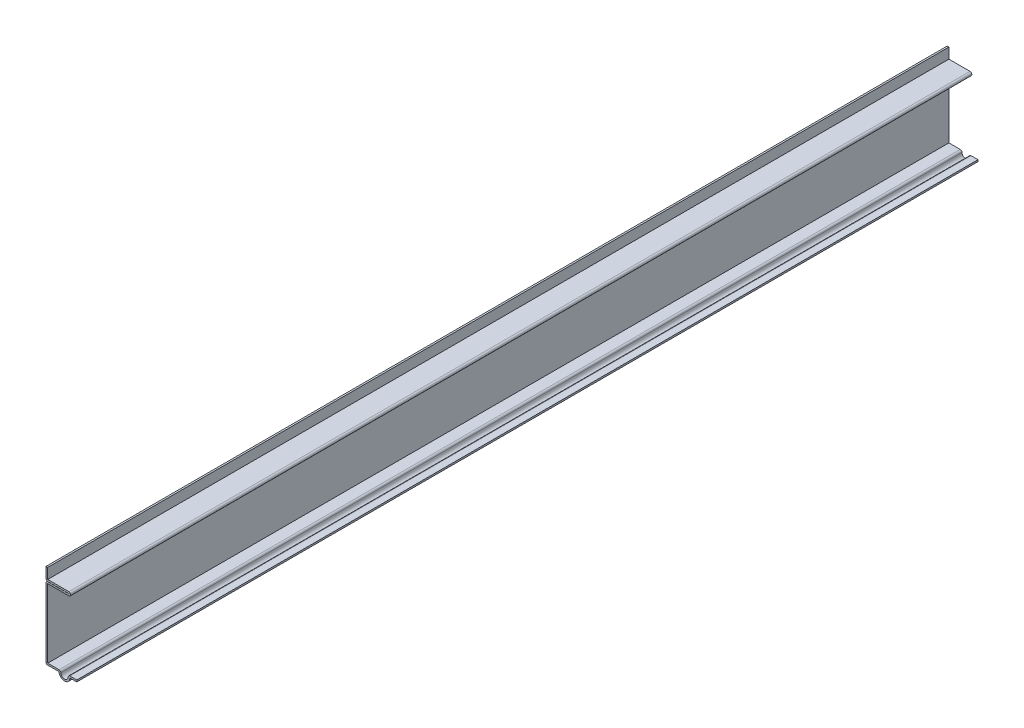
ISO-10303-21;
HEADER;
FILE_DESCRIPTION(('STEP AP214'),'2;1');
FILE_NAME('part.step','',(''),(''),'','','');
FILE_SCHEMA(('AUTOMOTIVE_DESIGN { 1 0 10303 214 1 1 1 1 }'));
ENDSEC;
DATA;
#1=APPLICATION_CONTEXT('core data for automotive mechanical design processes');
#2=APPLICATION_PROTOCOL_DEFINITION('international standard','automotive_design',2000,#1);
#3=PRODUCT_CONTEXT('',#1,'mechanical');
#4=PRODUCT('Part','Part','',(#3));
#5=PRODUCT_RELATED_PRODUCT_CATEGORY('part','',(#4));
#6=PRODUCT_DEFINITION_FORMATION('','',#4);
#7=PRODUCT_DEFINITION_CONTEXT('part definition',#1,'design');
#8=PRODUCT_DEFINITION('design','',#6,#7);
#9=PRODUCT_DEFINITION_SHAPE('','',#8);
#10=(LENGTH_UNIT() NAMED_UNIT(*) SI_UNIT(.MILLI.,.METRE.));
#11=(NAMED_UNIT(*) PLANE_ANGLE_UNIT() SI_UNIT($,.RADIAN.));
#12=(NAMED_UNIT(*) SI_UNIT($,.STERADIAN.) SOLID_ANGLE_UNIT());
#13=UNCERTAINTY_MEASURE_WITH_UNIT(LENGTH_MEASURE(1.E-05),#10,'distance_accuracy_value','');
#14=(GEOMETRIC_REPRESENTATION_CONTEXT(3) GLOBAL_UNCERTAINTY_ASSIGNED_CONTEXT((#13)) GLOBAL_UNIT_ASSIGNED_CONTEXT((#10,
#11,#12)) REPRESENTATION_CONTEXT('',''));
#15=CARTESIAN_POINT('',(0.,0.,0.));
#16=DIRECTION('',(0.,0.,1.));
#17=DIRECTION('',(1.,0.,0.));
#18=AXIS2_PLACEMENT_3D('',#15,#16,#17);
#19=CARTESIAN_POINT('',(-3.571875,0.,-464.34375));
#20=DIRECTION('',(0.,-1.,0.));
#21=DIRECTION('',(0.,0.,-1.));
#22=AXIS2_PLACEMENT_3D('',#19,#20,#21);
#23=PLANE('',#22);
#24=DIRECTION('',(1.,0.,0.));
#25=VECTOR('',#24,1.);
#26=CARTESIAN_POINT('',(-3.571875,0.,0.));
#27=LINE('',#26,#25);
#28=CARTESIAN_POINT('',(-3.571875,0.,0.));
#29=VERTEX_POINT('',#28);
#30=CARTESIAN_POINT('',(0.,0.,0.));
#31=VERTEX_POINT('',#30);
#32=EDGE_CURVE('E256',#29,#31,#27,.T.);
#33=ORIENTED_EDGE('',*,*,#32,.F.);
#34=DIRECTION('',(0.,0.,1.));
#35=VECTOR('',#34,1.);
#36=CARTESIAN_POINT('',(-3.571875,0.,-464.34375));
#37=LINE('',#36,#35);
#38=CARTESIAN_POINT('',(-3.571875,0.,-464.34375));
#39=VERTEX_POINT('',#38);
#40=EDGE_CURVE('E214',#39,#29,#37,.T.);
#41=ORIENTED_EDGE('',*,*,#40,.F.);
#42=DIRECTION('',(1.,0.,0.));
#43=VECTOR('',#42,1.);
#44=CARTESIAN_POINT('',(-3.571875,0.,-464.34375));
#45=LINE('',#44,#43);
#46=CARTESIAN_POINT('',(0.,0.,-464.34375));
#47=VERTEX_POINT('',#46);
#48=EDGE_CURVE('E196',#39,#47,#45,.T.);
#49=ORIENTED_EDGE('',*,*,#48,.T.);
#50=DIRECTION('',(0.,0.,1.));
#51=VECTOR('',#50,1.);
#52=CARTESIAN_POINT('',(0.,0.,-464.34375));
#53=LINE('',#52,#51);
#54=EDGE_CURVE('E204',#47,#31,#53,.T.);
#55=ORIENTED_EDGE('',*,*,#54,.T.);
#56=EDGE_LOOP('',(#33,#41,#49,#55));
#57=FACE_BOUND('',#56,.T.);
#58=ADVANCED_FACE('F35',(#57),#23,.T.);
#59=CARTESIAN_POINT('',(-6.35,0.,-464.34375));
#60=DIRECTION('',(0.,0.,1.));
#61=DIRECTION('',(1.,0.,0.));
#62=AXIS2_PLACEMENT_3D('',#59,#60,#61);
#63=CYLINDRICAL_SURFACE('',#62,2.778125);
#64=CARTESIAN_POINT('',(-6.35,0.,0.));
#65=DIRECTION('',(0.,0.,1.));
#66=DIRECTION('',(1.,0.,0.));
#67=AXIS2_PLACEMENT_3D('',#64,#65,#66);
#68=CIRCLE('',#67,2.778125);
#69=CARTESIAN_POINT('',(-9.128125,0.,0.));
#70=VERTEX_POINT('',#69);
#71=EDGE_CURVE('E215',#70,#29,#68,.T.);
#72=ORIENTED_EDGE('',*,*,#71,.F.);
#73=DIRECTION('',(0.,0.,1.));
#74=VECTOR('',#73,1.);
#75=CARTESIAN_POINT('',(-9.128125,0.,-464.34375));
#76=LINE('',#75,#74);
#77=CARTESIAN_POINT('',(-9.128125,0.,-464.34375));
#78=VERTEX_POINT('',#77);
#79=EDGE_CURVE('E295',#78,#70,#76,.T.);
#80=ORIENTED_EDGE('',*,*,#79,.F.);
#81=CARTESIAN_POINT('',(-6.35,0.,-464.34375));
#82=DIRECTION('',(0.,0.,1.));
#83=DIRECTION('',(1.,0.,0.));
#84=AXIS2_PLACEMENT_3D('',#81,#82,#83);
#85=CIRCLE('',#84,2.778125);
#86=EDGE_CURVE('E212',#78,#39,#85,.T.);
#87=ORIENTED_EDGE('',*,*,#86,.T.);
#88=ORIENTED_EDGE('',*,*,#40,.T.);
#89=EDGE_LOOP('',(#72,#80,#87,#88));
#90=FACE_BOUND('',#89,.T.);
#91=ADVANCED_FACE('F386',(#90),#63,.T.);
#92=CARTESIAN_POINT('',(-15.875,0.,-464.34375));
#93=DIRECTION('',(0.,-1.,0.));
#94=DIRECTION('',(0.,0.,-1.));
#95=AXIS2_PLACEMENT_3D('',#92,#93,#94);
#96=PLANE('',#95);
#97=DIRECTION('',(1.,0.,0.));
#98=VECTOR('',#97,1.);
#99=CARTESIAN_POINT('',(-15.875,0.,0.));
#100=LINE('',#99,#98);
#101=CARTESIAN_POINT('',(-14.986,0.,0.));
#102=VERTEX_POINT('',#101);
#103=EDGE_CURVE('E218',#102,#70,#100,.T.);
#104=ORIENTED_EDGE('',*,*,#103,.F.);
#105=DIRECTION('',(0.,0.,1.));
#106=VECTOR('',#105,1.);
#107=CARTESIAN_POINT('',(-14.986,0.,-464.34375));
#108=LINE('',#107,#106);
#109=CARTESIAN_POINT('',(-14.986,0.,-464.34375));
#110=VERTEX_POINT('',#109);
#111=EDGE_CURVE('E11',#102,#110,#108,.F.);
#112=ORIENTED_EDGE('',*,*,#111,.T.);
#113=DIRECTION('',(1.,0.,0.));
#114=VECTOR('',#113,1.);
#115=CARTESIAN_POINT('',(-15.875,0.,-464.34375));
#116=LINE('',#115,#114);
#117=EDGE_CURVE('E253',#110,#78,#116,.T.);
#118=ORIENTED_EDGE('',*,*,#117,.T.);
#119=ORIENTED_EDGE('',*,*,#79,.T.);
#120=EDGE_LOOP('',(#104,#112,#118,#119));
#121=FACE_BOUND('',#120,.T.);
#122=ADVANCED_FACE('F464',(#121),#96,.T.);
#123=CARTESIAN_POINT('',(-15.875,37.25545,-464.34375));
#124=DIRECTION('',(-1.,0.,0.));
#125=DIRECTION('',(0.,-1.,0.));
#126=AXIS2_PLACEMENT_3D('',#123,#124,#125);
#127=PLANE('',#126);
#128=DIRECTION('',(0.,-1.,0.));
#129=VECTOR('',#128,1.);
#130=CARTESIAN_POINT('',(-15.875,37.25545,0.));
#131=LINE('',#130,#129);
#132=CARTESIAN_POINT('',(-15.875,36.36645,0.));
#133=VERTEX_POINT('',#132);
#134=CARTESIAN_POINT('',(-15.875,0.889000000000001,0.));
#135=VERTEX_POINT('',#134);
#136=EDGE_CURVE('E289',#133,#135,#131,.T.);
#137=ORIENTED_EDGE('',*,*,#136,.F.);
#138=DIRECTION('',(0.,0.,1.));
#139=VECTOR('',#138,1.);
#140=CARTESIAN_POINT('',(-15.875,36.36645,-464.34375));
#141=LINE('',#140,#139);
#142=CARTESIAN_POINT('',(-15.875,36.36645,-464.34375));
#143=VERTEX_POINT('',#142);
#144=EDGE_CURVE('E339',#133,#143,#141,.F.);
#145=ORIENTED_EDGE('',*,*,#144,.T.);
#146=DIRECTION('',(0.,-1.,0.));
#147=VECTOR('',#146,1.);
#148=CARTESIAN_POINT('',(-15.875,37.25545,-464.34375));
#149=LINE('',#148,#147);
#150=CARTESIAN_POINT('',(-15.875,0.889000000000001,-464.34375));
#151=VERTEX_POINT('',#150);
#152=EDGE_CURVE('E250',#143,#151,#149,.T.);
#153=ORIENTED_EDGE('',*,*,#152,.T.);
#154=DIRECTION('',(0.,0.,1.));
#155=VECTOR('',#154,1.);
#156=CARTESIAN_POINT('',(-15.875,0.889000000000001,-464.34375));
#157=LINE('',#156,#155);
#158=EDGE_CURVE('E336',#151,#135,#157,.T.);
#159=ORIENTED_EDGE('',*,*,#158,.T.);
#160=EDGE_LOOP('',(#137,#145,#153,#159));
#161=FACE_BOUND('',#160,.T.);
#162=ADVANCED_FACE('F395',(#161),#127,.T.);
#163=CARTESIAN_POINT('',(-4.11480000000001,37.25545,-464.34375));
#164=DIRECTION('',(0.,1.,0.));
#165=DIRECTION('',(-1.,0.,0.));
#166=AXIS2_PLACEMENT_3D('',#163,#164,#165);
#167=PLANE('',#166);
#168=DIRECTION('',(-1.,0.,0.));
#169=VECTOR('',#168,1.);
#170=CARTESIAN_POINT('',(-4.11480000000001,37.25545,-464.34375));
#171=LINE('',#170,#169);
#172=CARTESIAN_POINT('',(-4.11480000000001,37.25545,-464.34375));
#173=VERTEX_POINT('',#172);
#174=CARTESIAN_POINT('',(-14.986,37.25545,-464.34375));
#175=VERTEX_POINT('',#174);
#176=EDGE_CURVE('E247',#173,#175,#171,.T.);
#177=ORIENTED_EDGE('',*,*,#176,.T.);
#178=DIRECTION('',(0.,0.,1.));
#179=VECTOR('',#178,1.);
#180=CARTESIAN_POINT('',(-14.986,37.25545,-464.34375));
#181=LINE('',#180,#179);
#182=CARTESIAN_POINT('',(-14.986,37.25545,0.));
#183=VERTEX_POINT('',#182);
#184=EDGE_CURVE('E294',#175,#183,#181,.T.);
#185=ORIENTED_EDGE('',*,*,#184,.T.);
#186=DIRECTION('',(-1.,0.,0.));
#187=VECTOR('',#186,1.);
#188=CARTESIAN_POINT('',(-4.11480000000001,37.25545,0.));
#189=LINE('',#188,#187);
#190=CARTESIAN_POINT('',(-4.11480000000001,37.25545,0.));
#191=VERTEX_POINT('',#190);
#192=EDGE_CURVE('E286',#191,#183,#189,.T.);
#193=ORIENTED_EDGE('',*,*,#192,.F.);
#194=DIRECTION('',(0.,0.,1.));
#195=VECTOR('',#194,1.);
#196=CARTESIAN_POINT('',(-4.11480000000001,37.25545,-464.34375));
#197=LINE('',#196,#195);
#198=EDGE_CURVE('E298',#173,#191,#197,.T.);
#199=ORIENTED_EDGE('',*,*,#198,.F.);
#200=EDGE_LOOP('',(#177,#185,#193,#199));
#201=FACE_BOUND('',#200,.T.);
#202=ADVANCED_FACE('F403',(#201),#167,.T.);
#203=CARTESIAN_POINT('',(-4.11480000000001,37.30625,-464.34375));
#204=DIRECTION('',(0.,0.,1.));
#205=DIRECTION('',(1.,0.,0.));
#206=AXIS2_PLACEMENT_3D('',#203,#204,#205);
#207=CYLINDRICAL_SURFACE('',#206,0.0508000000000002);
#208=CARTESIAN_POINT('',(-4.11480000000001,37.30625,0.));
#209=DIRECTION('',(0.,0.,-1.));
#210=DIRECTION('',(-1.,0.,0.));
#211=AXIS2_PLACEMENT_3D('',#208,#209,#210);
#212=CIRCLE('',#211,0.0508000000000002);
#213=CARTESIAN_POINT('',(-4.11480000000001,37.35705,0.));
#214=VERTEX_POINT('',#213);
#215=EDGE_CURVE('E283',#214,#191,#212,.T.);
#216=ORIENTED_EDGE('',*,*,#215,.F.);
#217=DIRECTION('',(0.,0.,1.));
#218=VECTOR('',#217,1.);
#219=CARTESIAN_POINT('',(-4.11480000000001,37.35705,-464.34375));
#220=LINE('',#219,#218);
#221=CARTESIAN_POINT('',(-4.11480000000001,37.35705,-464.34375));
#222=VERTEX_POINT('',#221);
#223=EDGE_CURVE('E300',#222,#214,#220,.T.);
#224=ORIENTED_EDGE('',*,*,#223,.F.);
#225=CARTESIAN_POINT('',(-4.11480000000001,37.30625,-464.34375));
#226=DIRECTION('',(0.,0.,-1.));
#227=DIRECTION('',(-1.,0.,0.));
#228=AXIS2_PLACEMENT_3D('',#225,#226,#227);
#229=CIRCLE('',#228,0.0508000000000002);
#230=EDGE_CURVE('E244',#222,#173,#229,.T.);
#231=ORIENTED_EDGE('',*,*,#230,.T.);
#232=ORIENTED_EDGE('',*,*,#198,.T.);
#233=EDGE_LOOP('',(#216,#224,#231,#232));
#234=FACE_BOUND('',#233,.T.);
#235=ADVANCED_FACE('F410',(#234),#207,.F.);
#236=CARTESIAN_POINT('',(-15.875,37.35705,-464.34375));
#237=DIRECTION('',(0.,-1.,0.));
#238=DIRECTION('',(0.,0.,-1.));
#239=AXIS2_PLACEMENT_3D('',#236,#237,#238);
#240=PLANE('',#239);
#241=DIRECTION('',(1.,0.,0.));
#242=VECTOR('',#241,1.);
#243=CARTESIAN_POINT('',(-15.875,37.35705,0.));
#244=LINE('',#243,#242);
#245=CARTESIAN_POINT('',(-14.986,37.35705,0.));
#246=VERTEX_POINT('',#245);
#247=EDGE_CURVE('E281',#246,#214,#244,.T.);
#248=ORIENTED_EDGE('',*,*,#247,.F.);
#249=DIRECTION('',(0.,0.,1.));
#250=VECTOR('',#249,1.);
#251=CARTESIAN_POINT('',(-14.986,37.35705,-464.34375));
#252=LINE('',#251,#250);
#253=CARTESIAN_POINT('',(-14.986,37.35705,-464.34375));
#254=VERTEX_POINT('',#253);
#255=EDGE_CURVE('E353',#246,#254,#252,.F.);
#256=ORIENTED_EDGE('',*,*,#255,.T.);
#257=DIRECTION('',(1.,0.,0.));
#258=VECTOR('',#257,1.);
#259=CARTESIAN_POINT('',(-15.875,37.35705,-464.34375));
#260=LINE('',#259,#258);
#261=EDGE_CURVE('E242',#254,#222,#260,.T.);
#262=ORIENTED_EDGE('',*,*,#261,.T.);
#263=ORIENTED_EDGE('',*,*,#223,.T.);
#264=EDGE_LOOP('',(#248,#256,#262,#263));
#265=FACE_BOUND('',#264,.T.);
#266=ADVANCED_FACE('F413',(#265),#240,.T.);
#267=CARTESIAN_POINT('',(-15.875,43.65625,-464.34375));
#268=DIRECTION('',(-1.,0.,0.));
#269=DIRECTION('',(0.,0.,1.));
#270=AXIS2_PLACEMENT_3D('',#267,#268,#269);
#271=PLANE('',#270);
#272=DIRECTION('',(0.,-1.,0.));
#273=VECTOR('',#272,1.);
#274=CARTESIAN_POINT('',(-15.875,43.65625,-464.34375));
#275=LINE('',#274,#273);
#276=CARTESIAN_POINT('',(-15.875,43.65625,-464.34375));
#277=VERTEX_POINT('',#276);
#278=CARTESIAN_POINT('',(-15.875,38.24605,-464.34375));
#279=VERTEX_POINT('',#278);
#280=EDGE_CURVE('E239',#277,#279,#275,.T.);
#281=ORIENTED_EDGE('',*,*,#280,.T.);
#282=DIRECTION('',(0.,0.,1.));
#283=VECTOR('',#282,1.);
#284=CARTESIAN_POINT('',(-15.875,38.24605,-464.34375));
#285=LINE('',#284,#283);
#286=CARTESIAN_POINT('',(-15.875,38.24605,0.));
#287=VERTEX_POINT('',#286);
#288=EDGE_CURVE('E350',#279,#287,#285,.T.);
#289=ORIENTED_EDGE('',*,*,#288,.T.);
#290=DIRECTION('',(0.,-1.,0.));
#291=VECTOR('',#290,1.);
#292=CARTESIAN_POINT('',(-15.875,43.65625,0.));
#293=LINE('',#292,#291);
#294=CARTESIAN_POINT('',(-15.875,43.65625,0.));
#295=VERTEX_POINT('',#294);
#296=EDGE_CURVE('E278',#295,#287,#293,.T.);
#297=ORIENTED_EDGE('',*,*,#296,.F.);
#298=DIRECTION('',(0.,0.,1.));
#299=VECTOR('',#298,1.);
#300=CARTESIAN_POINT('',(-15.875,43.65625,-464.34375));
#301=LINE('',#300,#299);
#302=EDGE_CURVE('E303',#277,#295,#301,.T.);
#303=ORIENTED_EDGE('',*,*,#302,.F.);
#304=EDGE_LOOP('',(#281,#289,#297,#303));
#305=FACE_BOUND('',#304,.T.);
#306=ADVANCED_FACE('F422',(#305),#271,.T.);
#307=CARTESIAN_POINT('',(-15.875,43.65625,-464.34375));
#308=DIRECTION('',(0.,-1.,0.));
#309=DIRECTION('',(0.,0.,-1.));
#310=AXIS2_PLACEMENT_3D('',#307,#308,#309);
#311=PLANE('',#310);
#312=DIRECTION('',(1.,0.,0.));
#313=VECTOR('',#312,1.);
#314=CARTESIAN_POINT('',(-15.875,43.65625,0.));
#315=LINE('',#314,#313);
#316=CARTESIAN_POINT('',(-14.986,43.65625,0.));
#317=VERTEX_POINT('',#316);
#318=EDGE_CURVE('E276',#295,#317,#315,.T.);
#319=ORIENTED_EDGE('',*,*,#318,.T.);
#320=DIRECTION('',(0.,0.,1.));
#321=VECTOR('',#320,1.);
#322=CARTESIAN_POINT('',(-14.986,43.65625,-464.34375));
#323=LINE('',#322,#321);
#324=CARTESIAN_POINT('',(-14.986,43.65625,-464.34375));
#325=VERTEX_POINT('',#324);
#326=EDGE_CURVE('E305',#325,#317,#323,.T.);
#327=ORIENTED_EDGE('',*,*,#326,.F.);
#328=DIRECTION('',(1.,0.,0.));
#329=VECTOR('',#328,1.);
#330=CARTESIAN_POINT('',(-15.875,43.65625,-464.34375));
#331=LINE('',#330,#329);
#332=EDGE_CURVE('E237',#277,#325,#331,.T.);
#333=ORIENTED_EDGE('',*,*,#332,.F.);
#334=ORIENTED_EDGE('',*,*,#302,.T.);
#335=EDGE_LOOP('',(#319,#327,#333,#334));
#336=FACE_BOUND('',#335,.T.);
#337=ADVANCED_FACE('F428',(#336),#311,.F.);
#338=CARTESIAN_POINT('',(-14.986,43.65625,-464.34375));
#339=DIRECTION('',(-1.,0.,0.));
#340=DIRECTION('',(0.,0.,1.));
#341=AXIS2_PLACEMENT_3D('',#338,#339,#340);
#342=PLANE('',#341);
#343=DIRECTION('',(0.,1.,0.));
#344=VECTOR('',#343,1.);
#345=CARTESIAN_POINT('',(-14.986,43.65625,0.));
#346=LINE('',#345,#344);
#347=CARTESIAN_POINT('',(-14.986,38.24605,0.));
#348=VERTEX_POINT('',#347);
#349=EDGE_CURVE('E274',#317,#348,#346,.F.);
#350=ORIENTED_EDGE('',*,*,#349,.T.);
#351=DIRECTION('',(0.,0.,1.));
#352=VECTOR('',#351,1.);
#353=CARTESIAN_POINT('',(-14.986,38.24605,-464.34375));
#354=LINE('',#353,#352);
#355=CARTESIAN_POINT('',(-14.986,38.24605,-464.34375));
#356=VERTEX_POINT('',#355);
#357=EDGE_CURVE('E308',#356,#348,#354,.T.);
#358=ORIENTED_EDGE('',*,*,#357,.F.);
#359=DIRECTION('',(0.,1.,0.));
#360=VECTOR('',#359,1.);
#361=CARTESIAN_POINT('',(-14.986,43.65625,-464.34375));
#362=LINE('',#361,#360);
#363=EDGE_CURVE('E235',#325,#356,#362,.F.);
#364=ORIENTED_EDGE('',*,*,#363,.F.);
#365=ORIENTED_EDGE('',*,*,#326,.T.);
#366=EDGE_LOOP('',(#350,#358,#364,#365));
#367=FACE_BOUND('',#366,.T.);
#368=ADVANCED_FACE('F432',(#367),#342,.F.);
#369=CARTESIAN_POINT('',(-15.875,38.24605,-464.34375));
#370=DIRECTION('',(0.,-1.,0.));
#371=DIRECTION('',(0.,0.,-1.));
#372=AXIS2_PLACEMENT_3D('',#369,#370,#371);
#373=PLANE('',#372);
#374=DIRECTION('',(1.,0.,0.));
#375=VECTOR('',#374,1.);
#376=CARTESIAN_POINT('',(-15.875,38.24605,0.));
#377=LINE('',#376,#375);
#378=CARTESIAN_POINT('',(-4.11480000000001,38.24605,0.));
#379=VERTEX_POINT('',#378);
#380=EDGE_CURVE('E272',#348,#379,#377,.T.);
#381=ORIENTED_EDGE('',*,*,#380,.T.);
#382=DIRECTION('',(0.,0.,1.));
#383=VECTOR('',#382,1.);
#384=CARTESIAN_POINT('',(-4.11480000000001,38.24605,-464.34375));
#385=LINE('',#384,#383);
#386=CARTESIAN_POINT('',(-4.11480000000001,38.24605,-464.34375));
#387=VERTEX_POINT('',#386);
#388=EDGE_CURVE('E311',#387,#379,#385,.T.);
#389=ORIENTED_EDGE('',*,*,#388,.F.);
#390=DIRECTION('',(1.,0.,0.));
#391=VECTOR('',#390,1.);
#392=CARTESIAN_POINT('',(-15.875,38.24605,-464.34375));
#393=LINE('',#392,#391);
#394=EDGE_CURVE('E233',#356,#387,#393,.T.);
#395=ORIENTED_EDGE('',*,*,#394,.F.);
#396=ORIENTED_EDGE('',*,*,#357,.T.);
#397=EDGE_LOOP('',(#381,#389,#395,#396));
#398=FACE_BOUND('',#397,.T.);
#399=ADVANCED_FACE('F439',(#398),#373,.F.);
#400=CARTESIAN_POINT('',(-4.11480000000001,37.30625,-464.34375));
#401=DIRECTION('',(0.,0.,1.));
#402=DIRECTION('',(1.,0.,0.));
#403=AXIS2_PLACEMENT_3D('',#400,#401,#402);
#404=CYLINDRICAL_SURFACE('',#403,0.9398);
#405=CARTESIAN_POINT('',(-4.11480000000001,37.30625,0.));
#406=DIRECTION('',(0.,0.,1.));
#407=DIRECTION('',(1.,0.,0.));
#408=AXIS2_PLACEMENT_3D('',#405,#406,#407);
#409=CIRCLE('',#408,0.9398);
#410=CARTESIAN_POINT('',(-4.11480000000001,36.36645,0.));
#411=VERTEX_POINT('',#410);
#412=EDGE_CURVE('E270',#379,#411,#409,.F.);
#413=ORIENTED_EDGE('',*,*,#412,.T.);
#414=DIRECTION('',(0.,0.,1.));
#415=VECTOR('',#414,1.);
#416=CARTESIAN_POINT('',(-4.11480000000001,36.36645,-464.34375));
#417=LINE('',#416,#415);
#418=CARTESIAN_POINT('',(-4.11480000000001,36.36645,-464.34375));
#419=VERTEX_POINT('',#418);
#420=EDGE_CURVE('E314',#419,#411,#417,.T.);
#421=ORIENTED_EDGE('',*,*,#420,.F.);
#422=CARTESIAN_POINT('',(-4.11480000000001,37.30625,-464.34375));
#423=DIRECTION('',(0.,0.,1.));
#424=DIRECTION('',(1.,0.,0.));
#425=AXIS2_PLACEMENT_3D('',#422,#423,#424);
#426=CIRCLE('',#425,0.9398);
#427=EDGE_CURVE('E231',#387,#419,#426,.F.);
#428=ORIENTED_EDGE('',*,*,#427,.F.);
#429=ORIENTED_EDGE('',*,*,#388,.T.);
#430=EDGE_LOOP('',(#413,#421,#428,#429));
#431=FACE_BOUND('',#430,.T.);
#432=ADVANCED_FACE('F442',(#431),#404,.T.);
#433=CARTESIAN_POINT('',(-4.11480000000001,36.36645,-464.34375));
#434=DIRECTION('',(0.,1.,0.));
#435=DIRECTION('',(-1.,0.,0.));
#436=AXIS2_PLACEMENT_3D('',#433,#434,#435);
#437=PLANE('',#436);
#438=DIRECTION('',(-1.,0.,0.));
#439=VECTOR('',#438,1.);
#440=CARTESIAN_POINT('',(-4.11480000000001,36.36645,0.));
#441=LINE('',#440,#439);
#442=CARTESIAN_POINT('',(-14.986,36.36645,0.));
#443=VERTEX_POINT('',#442);
#444=EDGE_CURVE('E268',#411,#443,#441,.T.);
#445=ORIENTED_EDGE('',*,*,#444,.T.);
#446=DIRECTION('',(0.,0.,1.));
#447=VECTOR('',#446,1.);
#448=CARTESIAN_POINT('',(-14.986,36.36645,-464.34375));
#449=LINE('',#448,#447);
#450=CARTESIAN_POINT('',(-14.986,36.36645,-464.34375));
#451=VERTEX_POINT('',#450);
#452=EDGE_CURVE('E317',#451,#443,#449,.T.);
#453=ORIENTED_EDGE('',*,*,#452,.F.);
#454=DIRECTION('',(-1.,0.,0.));
#455=VECTOR('',#454,1.);
#456=CARTESIAN_POINT('',(-4.11480000000001,36.36645,-464.34375));
#457=LINE('',#456,#455);
#458=EDGE_CURVE('E229',#419,#451,#457,.T.);
#459=ORIENTED_EDGE('',*,*,#458,.F.);
#460=ORIENTED_EDGE('',*,*,#420,.T.);
#461=EDGE_LOOP('',(#445,#453,#459,#460));
#462=FACE_BOUND('',#461,.T.);
#463=ADVANCED_FACE('F447',(#462),#437,.F.);
#464=CARTESIAN_POINT('',(-14.986,37.25545,-464.34375));
#465=DIRECTION('',(-1.,0.,0.));
#466=DIRECTION('',(0.,-1.,0.));
#467=AXIS2_PLACEMENT_3D('',#464,#465,#466);
#468=PLANE('',#467);
#469=DIRECTION('',(0.,-1.,0.));
#470=VECTOR('',#469,1.);
#471=CARTESIAN_POINT('',(-14.986,37.25545,0.));
#472=LINE('',#471,#470);
#473=CARTESIAN_POINT('',(-14.986,0.889,0.));
#474=VERTEX_POINT('',#473);
#475=EDGE_CURVE('E266',#443,#474,#472,.T.);
#476=ORIENTED_EDGE('',*,*,#475,.T.);
#477=DIRECTION('',(0.,0.,1.));
#478=VECTOR('',#477,1.);
#479=CARTESIAN_POINT('',(-14.986,0.889,-464.34375));
#480=LINE('',#479,#478);
#481=CARTESIAN_POINT('',(-14.986,0.889,-464.34375));
#482=VERTEX_POINT('',#481);
#483=EDGE_CURVE('E320',#482,#474,#480,.T.);
#484=ORIENTED_EDGE('',*,*,#483,.F.);
#485=DIRECTION('',(0.,-1.,0.));
#486=VECTOR('',#485,1.);
#487=CARTESIAN_POINT('',(-14.986,37.25545,-464.34375));
#488=LINE('',#487,#486);
#489=EDGE_CURVE('E227',#451,#482,#488,.T.);
#490=ORIENTED_EDGE('',*,*,#489,.F.);
#491=ORIENTED_EDGE('',*,*,#452,.T.);
#492=EDGE_LOOP('',(#476,#484,#490,#491));
#493=FACE_BOUND('',#492,.T.);
#494=ADVANCED_FACE('F450',(#493),#468,.F.);
#495=CARTESIAN_POINT('',(-15.875,0.889,-464.34375));
#496=DIRECTION('',(0.,-1.,0.));
#497=DIRECTION('',(0.,0.,-1.));
#498=AXIS2_PLACEMENT_3D('',#495,#496,#497);
#499=PLANE('',#498);
#500=DIRECTION('',(1.,0.,0.));
#501=VECTOR('',#500,1.);
#502=CARTESIAN_POINT('',(-15.875,0.889,0.));
#503=LINE('',#502,#501);
#504=CARTESIAN_POINT('',(-9.128125,0.889,0.));
#505=VERTEX_POINT('',#504);
#506=EDGE_CURVE('E263',#474,#505,#503,.T.);
#507=ORIENTED_EDGE('',*,*,#506,.T.);
#508=DIRECTION('',(0.,0.,1.));
#509=VECTOR('',#508,1.);
#510=CARTESIAN_POINT('',(-9.128125,0.889,-464.34375));
#511=LINE('',#510,#509);
#512=CARTESIAN_POINT('',(-9.128125,0.889,-464.34375));
#513=VERTEX_POINT('',#512);
#514=EDGE_CURVE('E43',#505,#513,#511,.F.);
#515=ORIENTED_EDGE('',*,*,#514,.T.);
#516=DIRECTION('',(1.,0.,0.));
#517=VECTOR('',#516,1.);
#518=CARTESIAN_POINT('',(-15.875,0.889,-464.34375));
#519=LINE('',#518,#517);
#520=EDGE_CURVE('E224',#482,#513,#519,.T.);
#521=ORIENTED_EDGE('',*,*,#520,.F.);
#522=ORIENTED_EDGE('',*,*,#483,.T.);
#523=EDGE_LOOP('',(#507,#515,#521,#522));
#524=FACE_BOUND('',#523,.T.);
#525=ADVANCED_FACE('F364',(#524),#499,.F.);
#526=CARTESIAN_POINT('',(-6.35,0.,-464.34375));
#527=DIRECTION('',(0.,0.,1.));
#528=DIRECTION('',(1.,0.,0.));
#529=AXIS2_PLACEMENT_3D('',#526,#527,#528);
#530=CYLINDRICAL_SURFACE('',#529,1.889125);
#531=CARTESIAN_POINT('',(-6.35,0.,0.));
#532=DIRECTION('',(0.,0.,1.));
#533=DIRECTION('',(1.,0.,0.));
#534=AXIS2_PLACEMENT_3D('',#531,#532,#533);
#535=CIRCLE('',#534,1.889125);
#536=CARTESIAN_POINT('',(-8.239125,0.,0.));
#537=VERTEX_POINT('',#536);
#538=CARTESIAN_POINT('',(-4.460875,0.,0.));
#539=VERTEX_POINT('',#538);
#540=EDGE_CURVE('E261',#537,#539,#535,.T.);
#541=ORIENTED_EDGE('',*,*,#540,.T.);
#542=DIRECTION('',(0.,0.,1.));
#543=VECTOR('',#542,1.);
#544=CARTESIAN_POINT('',(-4.460875,0.,-464.34375));
#545=LINE('',#544,#543);
#546=CARTESIAN_POINT('',(-4.460875,0.,-464.34375));
#547=VERTEX_POINT('',#546);
#548=EDGE_CURVE('E58',#539,#547,#545,.F.);
#549=ORIENTED_EDGE('',*,*,#548,.T.);
#550=CARTESIAN_POINT('',(-6.35,0.,-464.34375));
#551=DIRECTION('',(0.,0.,1.));
#552=DIRECTION('',(1.,0.,0.));
#553=AXIS2_PLACEMENT_3D('',#550,#551,#552);
#554=CIRCLE('',#553,1.889125);
#555=CARTESIAN_POINT('',(-8.239125,0.,-464.34375));
#556=VERTEX_POINT('',#555);
#557=EDGE_CURVE('E222',#556,#547,#554,.T.);
#558=ORIENTED_EDGE('',*,*,#557,.F.);
#559=DIRECTION('',(0.,0.,1.));
#560=VECTOR('',#559,1.);
#561=CARTESIAN_POINT('',(-8.239125,0.,-464.34375));
#562=LINE('',#561,#560);
#563=EDGE_CURVE('E358',#556,#537,#562,.T.);
#564=ORIENTED_EDGE('',*,*,#563,.T.);
#565=EDGE_LOOP('',(#541,#549,#558,#564));
#566=FACE_BOUND('',#565,.T.);
#567=ADVANCED_FACE('F373',(#566),#530,.F.);
#568=CARTESIAN_POINT('',(-3.571875,0.889,-464.34375));
#569=DIRECTION('',(0.,-1.,0.));
#570=DIRECTION('',(0.,0.,-1.));
#571=AXIS2_PLACEMENT_3D('',#568,#569,#570);
#572=PLANE('',#571);
#573=DIRECTION('',(1.,0.,0.));
#574=VECTOR('',#573,1.);
#575=CARTESIAN_POINT('',(-3.571875,0.889,-464.34375));
#576=LINE('',#575,#574);
#577=CARTESIAN_POINT('',(-3.571875,0.889,-464.34375));
#578=VERTEX_POINT('',#577);
#579=CARTESIAN_POINT('',(0.,0.889,-464.34375));
#580=VERTEX_POINT('',#579);
#581=EDGE_CURVE('E198',#578,#580,#576,.T.);
#582=ORIENTED_EDGE('',*,*,#581,.F.);
#583=DIRECTION('',(0.,0.,1.));
#584=VECTOR('',#583,1.);
#585=CARTESIAN_POINT('',(-3.571875,0.889,-464.34375));
#586=LINE('',#585,#584);
#587=CARTESIAN_POINT('',(-3.571875,0.889,0.));
#588=VERTEX_POINT('',#587);
#589=EDGE_CURVE('E355',#578,#588,#586,.T.);
#590=ORIENTED_EDGE('',*,*,#589,.T.);
#591=DIRECTION('',(1.,0.,0.));
#592=VECTOR('',#591,1.);
#593=CARTESIAN_POINT('',(-3.571875,0.889,0.));
#594=LINE('',#593,#592);
#595=CARTESIAN_POINT('',(0.,0.889,0.));
#596=VERTEX_POINT('',#595);
#597=EDGE_CURVE('E259',#588,#596,#594,.T.);
#598=ORIENTED_EDGE('',*,*,#597,.T.);
#599=DIRECTION('',(0.,0.,1.));
#600=VECTOR('',#599,1.);
#601=CARTESIAN_POINT('',(0.,0.889,-464.34375));
#602=LINE('',#601,#600);
#603=EDGE_CURVE('E211',#580,#596,#602,.T.);
#604=ORIENTED_EDGE('',*,*,#603,.F.);
#605=EDGE_LOOP('',(#582,#590,#598,#604));
#606=FACE_BOUND('',#605,.T.);
#607=ADVANCED_FACE('F381',(#606),#572,.F.);
#608=CARTESIAN_POINT('',(0.,0.889,-464.34375));
#609=DIRECTION('',(-1.,0.,0.));
#610=DIRECTION('',(0.,0.,1.));
#611=AXIS2_PLACEMENT_3D('',#608,#609,#610);
#612=PLANE('',#611);
#613=DIRECTION('',(0.,-1.,0.));
#614=VECTOR('',#613,1.);
#615=CARTESIAN_POINT('',(0.,0.889,0.));
#616=LINE('',#615,#614);
#617=EDGE_CURVE('E207',#596,#31,#616,.T.);
#618=ORIENTED_EDGE('',*,*,#617,.T.);
#619=ORIENTED_EDGE('',*,*,#54,.F.);
#620=DIRECTION('',(0.,-1.,0.));
#621=VECTOR('',#620,1.);
#622=CARTESIAN_POINT('',(0.,0.889,-464.34375));
#623=LINE('',#622,#621);
#624=EDGE_CURVE('E190',#580,#47,#623,.T.);
#625=ORIENTED_EDGE('',*,*,#624,.F.);
#626=ORIENTED_EDGE('',*,*,#603,.T.);
#627=EDGE_LOOP('',(#618,#619,#625,#626));
#628=FACE_BOUND('',#627,.T.);
#629=ADVANCED_FACE('F205',(#628),#612,.F.);
#630=CARTESIAN_POINT('',(-6.35,0.,-464.34375));
#631=DIRECTION('',(0.,0.,1.));
#632=DIRECTION('',(1.,0.,0.));
#633=AXIS2_PLACEMENT_3D('',#630,#631,#632);
#634=PLANE('',#633);
#635=ORIENTED_EDGE('',*,*,#152,.F.);
#636=CARTESIAN_POINT('',(-14.986,36.36645,-464.34375));
#637=DIRECTION('',(0.,0.,1.));
#638=DIRECTION('',(1.,0.,0.));
#639=AXIS2_PLACEMENT_3D('',#636,#637,#638);
#640=CIRCLE('',#639,0.889);
#641=EDGE_CURVE('E348',#143,#175,#640,.F.);
#642=ORIENTED_EDGE('',*,*,#641,.T.);
#643=ORIENTED_EDGE('',*,*,#176,.F.);
#644=ORIENTED_EDGE('',*,*,#230,.F.);
#645=ORIENTED_EDGE('',*,*,#261,.F.);
#646=CARTESIAN_POINT('',(-14.986,38.24605,-464.34375));
#647=DIRECTION('',(0.,0.,1.));
#648=DIRECTION('',(1.,0.,0.));
#649=AXIS2_PLACEMENT_3D('',#646,#647,#648);
#650=CIRCLE('',#649,0.889);
#651=EDGE_CURVE('E346',#254,#279,#650,.F.);
#652=ORIENTED_EDGE('',*,*,#651,.T.);
#653=ORIENTED_EDGE('',*,*,#280,.F.);
#654=ORIENTED_EDGE('',*,*,#332,.T.);
#655=ORIENTED_EDGE('',*,*,#363,.T.);
#656=ORIENTED_EDGE('',*,*,#394,.T.);
#657=ORIENTED_EDGE('',*,*,#427,.T.);
#658=ORIENTED_EDGE('',*,*,#458,.T.);
#659=ORIENTED_EDGE('',*,*,#489,.T.);
#660=ORIENTED_EDGE('',*,*,#520,.T.);
#661=CARTESIAN_POINT('',(-9.128125,0.,-464.34375));
#662=DIRECTION('',(0.,0.,1.));
#663=DIRECTION('',(1.,0.,0.));
#664=AXIS2_PLACEMENT_3D('',#661,#662,#663);
#665=CIRCLE('',#664,0.889);
#666=EDGE_CURVE('E343',#513,#556,#665,.F.);
#667=ORIENTED_EDGE('',*,*,#666,.T.);
#668=ORIENTED_EDGE('',*,*,#557,.T.);
#669=CARTESIAN_POINT('',(-3.571875,0.,-464.34375));
#670=DIRECTION('',(0.,0.,1.));
#671=DIRECTION('',(1.,0.,0.));
#672=AXIS2_PLACEMENT_3D('',#669,#670,#671);
#673=CIRCLE('',#672,0.889);
#674=EDGE_CURVE('E50',#547,#578,#673,.F.);
#675=ORIENTED_EDGE('',*,*,#674,.T.);
#676=ORIENTED_EDGE('',*,*,#581,.T.);
#677=ORIENTED_EDGE('',*,*,#624,.T.);
#678=ORIENTED_EDGE('',*,*,#48,.F.);
#679=ORIENTED_EDGE('',*,*,#86,.F.);
#680=ORIENTED_EDGE('',*,*,#117,.F.);
#681=CARTESIAN_POINT('',(-14.986,0.889000000000001,-464.34375));
#682=DIRECTION('',(0.,0.,1.));
#683=DIRECTION('',(1.,0.,0.));
#684=AXIS2_PLACEMENT_3D('',#681,#682,#683);
#685=CIRCLE('',#684,0.889);
#686=EDGE_CURVE('E341',#110,#151,#685,.F.);
#687=ORIENTED_EDGE('',*,*,#686,.T.);
#688=EDGE_LOOP('',(#635,#642,#643,#644,#645,#652,#653,#654,#655,#656,#657,#658,#659,#660,#667,
#668,#675,#676,#677,#678,#679,#680,#687));
#689=FACE_BOUND('',#688,.T.);
#690=ADVANCED_FACE('F193',(#689),#634,.F.);
#691=CARTESIAN_POINT('',(-6.35,0.,0.));
#692=DIRECTION('',(0.,0.,1.));
#693=DIRECTION('',(1.,0.,0.));
#694=AXIS2_PLACEMENT_3D('',#691,#692,#693);
#695=PLANE('',#694);
#696=ORIENTED_EDGE('',*,*,#192,.T.);
#697=CARTESIAN_POINT('',(-14.986,36.36645,0.));
#698=DIRECTION('',(0.,0.,1.));
#699=DIRECTION('',(1.,0.,0.));
#700=AXIS2_PLACEMENT_3D('',#697,#698,#699);
#701=CIRCLE('',#700,0.889);
#702=EDGE_CURVE('E334',#183,#133,#701,.T.);
#703=ORIENTED_EDGE('',*,*,#702,.T.);
#704=ORIENTED_EDGE('',*,*,#136,.T.);
#705=CARTESIAN_POINT('',(-14.986,0.889000000000001,0.));
#706=DIRECTION('',(0.,0.,1.));
#707=DIRECTION('',(1.,0.,0.));
#708=AXIS2_PLACEMENT_3D('',#705,#706,#707);
#709=CIRCLE('',#708,0.889);
#710=EDGE_CURVE('E326',#135,#102,#709,.T.);
#711=ORIENTED_EDGE('',*,*,#710,.T.);
#712=ORIENTED_EDGE('',*,*,#103,.T.);
#713=ORIENTED_EDGE('',*,*,#71,.T.);
#714=ORIENTED_EDGE('',*,*,#32,.T.);
#715=ORIENTED_EDGE('',*,*,#617,.F.);
#716=ORIENTED_EDGE('',*,*,#597,.F.);
#717=CARTESIAN_POINT('',(-3.571875,0.,0.));
#718=DIRECTION('',(0.,0.,1.));
#719=DIRECTION('',(1.,0.,0.));
#720=AXIS2_PLACEMENT_3D('',#717,#718,#719);
#721=CIRCLE('',#720,0.889);
#722=EDGE_CURVE('E330',#588,#539,#721,.T.);
#723=ORIENTED_EDGE('',*,*,#722,.T.);
#724=ORIENTED_EDGE('',*,*,#540,.F.);
#725=CARTESIAN_POINT('',(-9.128125,0.,0.));
#726=DIRECTION('',(0.,0.,1.));
#727=DIRECTION('',(1.,0.,0.));
#728=AXIS2_PLACEMENT_3D('',#725,#726,#727);
#729=CIRCLE('',#728,0.889);
#730=EDGE_CURVE('E328',#537,#505,#729,.T.);
#731=ORIENTED_EDGE('',*,*,#730,.T.);
#732=ORIENTED_EDGE('',*,*,#506,.F.);
#733=ORIENTED_EDGE('',*,*,#475,.F.);
#734=ORIENTED_EDGE('',*,*,#444,.F.);
#735=ORIENTED_EDGE('',*,*,#412,.F.);
#736=ORIENTED_EDGE('',*,*,#380,.F.);
#737=ORIENTED_EDGE('',*,*,#349,.F.);
#738=ORIENTED_EDGE('',*,*,#318,.F.);
#739=ORIENTED_EDGE('',*,*,#296,.T.);
#740=CARTESIAN_POINT('',(-14.986,38.24605,0.));
#741=DIRECTION('',(0.,0.,1.));
#742=DIRECTION('',(1.,0.,0.));
#743=AXIS2_PLACEMENT_3D('',#740,#741,#742);
#744=CIRCLE('',#743,0.889);
#745=EDGE_CURVE('E332',#287,#246,#744,.T.);
#746=ORIENTED_EDGE('',*,*,#745,.T.);
#747=ORIENTED_EDGE('',*,*,#247,.T.);
#748=ORIENTED_EDGE('',*,*,#215,.T.);
#749=EDGE_LOOP('',(#696,#703,#704,#711,#712,#713,#714,#715,#716,#723,#724,#731,#732,#733,#734,
#735,#736,#737,#738,#739,#746,#747,#748));
#750=FACE_BOUND('',#749,.T.);
#751=ADVANCED_FACE('F375',(#750),#695,.T.);
#752=CARTESIAN_POINT('',(-14.986,36.36645,-464.34375));
#753=DIRECTION('',(0.,0.,1.));
#754=DIRECTION('',(1.,0.,0.));
#755=AXIS2_PLACEMENT_3D('',#752,#753,#754);
#756=CYLINDRICAL_SURFACE('',#755,0.889);
#757=ORIENTED_EDGE('',*,*,#641,.F.);
#758=ORIENTED_EDGE('',*,*,#144,.F.);
#759=ORIENTED_EDGE('',*,*,#702,.F.);
#760=ORIENTED_EDGE('',*,*,#184,.F.);
#761=EDGE_LOOP('',(#757,#758,#759,#760));
#762=FACE_BOUND('',#761,.T.);
#763=ADVANCED_FACE('F401',(#762),#756,.T.);
#764=CARTESIAN_POINT('',(-14.986,38.24605,-464.34375));
#765=DIRECTION('',(0.,0.,1.));
#766=DIRECTION('',(1.,0.,0.));
#767=AXIS2_PLACEMENT_3D('',#764,#765,#766);
#768=CYLINDRICAL_SURFACE('',#767,0.889);
#769=ORIENTED_EDGE('',*,*,#651,.F.);
#770=ORIENTED_EDGE('',*,*,#255,.F.);
#771=ORIENTED_EDGE('',*,*,#745,.F.);
#772=ORIENTED_EDGE('',*,*,#288,.F.);
#773=EDGE_LOOP('',(#769,#770,#771,#772));
#774=FACE_BOUND('',#773,.T.);
#775=ADVANCED_FACE('F419',(#774),#768,.T.);
#776=CARTESIAN_POINT('',(-3.571875,0.,-464.34375));
#777=DIRECTION('',(0.,0.,1.));
#778=DIRECTION('',(1.,0.,0.));
#779=AXIS2_PLACEMENT_3D('',#776,#777,#778);
#780=CYLINDRICAL_SURFACE('',#779,0.889);
#781=ORIENTED_EDGE('',*,*,#674,.F.);
#782=ORIENTED_EDGE('',*,*,#548,.F.);
#783=ORIENTED_EDGE('',*,*,#722,.F.);
#784=ORIENTED_EDGE('',*,*,#589,.F.);
#785=EDGE_LOOP('',(#781,#782,#783,#784));
#786=FACE_BOUND('',#785,.T.);
#787=ADVANCED_FACE('F379',(#786),#780,.T.);
#788=CARTESIAN_POINT('',(-9.128125,0.,-464.34375));
#789=DIRECTION('',(0.,0.,1.));
#790=DIRECTION('',(1.,0.,0.));
#791=AXIS2_PLACEMENT_3D('',#788,#789,#790);
#792=CYLINDRICAL_SURFACE('',#791,0.889);
#793=ORIENTED_EDGE('',*,*,#666,.F.);
#794=ORIENTED_EDGE('',*,*,#514,.F.);
#795=ORIENTED_EDGE('',*,*,#730,.F.);
#796=ORIENTED_EDGE('',*,*,#563,.F.);
#797=EDGE_LOOP('',(#793,#794,#795,#796));
#798=FACE_BOUND('',#797,.T.);
#799=ADVANCED_FACE('F371',(#798),#792,.T.);
#800=CARTESIAN_POINT('',(-14.986,0.889000000000001,-464.34375));
#801=DIRECTION('',(0.,0.,1.));
#802=DIRECTION('',(1.,0.,0.));
#803=AXIS2_PLACEMENT_3D('',#800,#801,#802);
#804=CYLINDRICAL_SURFACE('',#803,0.889);
#805=ORIENTED_EDGE('',*,*,#686,.F.);
#806=ORIENTED_EDGE('',*,*,#111,.F.);
#807=ORIENTED_EDGE('',*,*,#710,.F.);
#808=ORIENTED_EDGE('',*,*,#158,.F.);
#809=EDGE_LOOP('',(#805,#806,#807,#808));
#810=FACE_BOUND('',#809,.T.);
#811=ADVANCED_FACE('F37',(#810),#804,.T.);
#812=CLOSED_SHELL('',(#58,#91,#122,#162,#202,#235,#266,#306,#337,#368,#399,#432,#463,#494,#525,
#567,#607,#629,#690,#751,#763,#775,#787,#799,#811));
#813=MANIFOLD_SOLID_BREP('B2',#812);
#814=ADVANCED_BREP_SHAPE_REPRESENTATION('',(#18,#813),#14);
#815=SHAPE_DEFINITION_REPRESENTATION(#9,#814);
ENDSEC;
END-ISO-10303-21;
